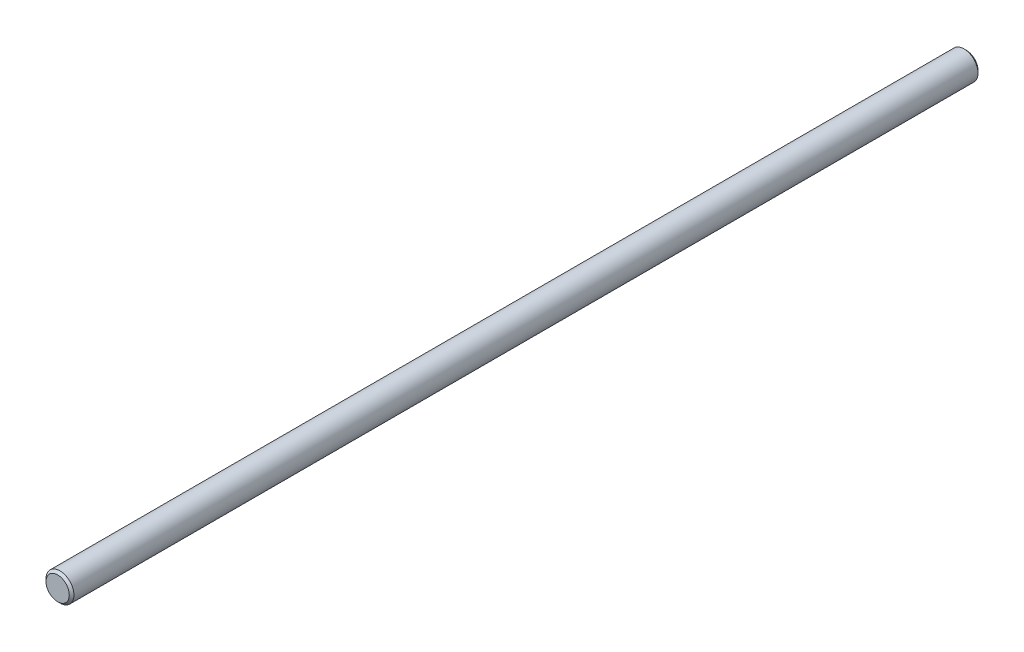
ISO-10303-21;
HEADER;
FILE_DESCRIPTION(('STEP AP214'),'2;1');
FILE_NAME('part.step','',(''),(''),'','','');
FILE_SCHEMA(('AUTOMOTIVE_DESIGN { 1 0 10303 214 1 1 1 1 }'));
ENDSEC;
DATA;
#1=APPLICATION_CONTEXT('core data for automotive mechanical design processes');
#2=APPLICATION_PROTOCOL_DEFINITION('international standard','automotive_design',2000,#1);
#3=PRODUCT_CONTEXT('',#1,'mechanical');
#4=PRODUCT('Part','Part','',(#3));
#5=PRODUCT_RELATED_PRODUCT_CATEGORY('part','',(#4));
#6=PRODUCT_DEFINITION_FORMATION('','',#4);
#7=PRODUCT_DEFINITION_CONTEXT('part definition',#1,'design');
#8=PRODUCT_DEFINITION('design','',#6,#7);
#9=PRODUCT_DEFINITION_SHAPE('','',#8);
#10=(LENGTH_UNIT() NAMED_UNIT(*) SI_UNIT(.MILLI.,.METRE.));
#11=(NAMED_UNIT(*) PLANE_ANGLE_UNIT() SI_UNIT($,.RADIAN.));
#12=(NAMED_UNIT(*) SI_UNIT($,.STERADIAN.) SOLID_ANGLE_UNIT());
#13=UNCERTAINTY_MEASURE_WITH_UNIT(LENGTH_MEASURE(1.E-05),#10,'distance_accuracy_value','');
#14=(GEOMETRIC_REPRESENTATION_CONTEXT(3) GLOBAL_UNCERTAINTY_ASSIGNED_CONTEXT((#13)) GLOBAL_UNIT_ASSIGNED_CONTEXT((#10,
#11,#12)) REPRESENTATION_CONTEXT('',''));
#15=CARTESIAN_POINT('',(0.,0.,0.));
#16=DIRECTION('',(0.,0.,1.));
#17=DIRECTION('',(1.,0.,0.));
#18=AXIS2_PLACEMENT_3D('',#15,#16,#17);
#19=CARTESIAN_POINT('',(0.,0.,390.));
#20=DIRECTION('',(0.,0.,-1.));
#21=DIRECTION('',(-1.,0.,0.));
#22=AXIS2_PLACEMENT_3D('',#19,#20,#21);
#23=CYLINDRICAL_SURFACE('',#22,6.);
#24=CARTESIAN_POINT('',(0.,0.,389.));
#25=DIRECTION('',(0.,0.,1.));
#26=DIRECTION('',(1.,0.,0.));
#27=AXIS2_PLACEMENT_3D('',#24,#25,#26);
#28=CIRCLE('',#27,6.);
#29=CARTESIAN_POINT('',(6.,0.,389.));
#30=VERTEX_POINT('',#29);
#31=EDGE_CURVE('E38',#30,#30,#28,.F.);
#32=ORIENTED_EDGE('',*,*,#31,.T.);
#33=EDGE_LOOP('',(#32));
#34=FACE_BOUND('',#33,.T.);
#35=CARTESIAN_POINT('',(0.,0.,0.999999999999945));
#36=DIRECTION('',(0.,0.,1.));
#37=DIRECTION('',(1.,0.,0.));
#38=AXIS2_PLACEMENT_3D('',#35,#36,#37);
#39=CIRCLE('',#38,6.);
#40=CARTESIAN_POINT('',(6.,0.,0.999999999999945));
#41=VERTEX_POINT('',#40);
#42=EDGE_CURVE('E42',#41,#41,#39,.T.);
#43=ORIENTED_EDGE('',*,*,#42,.T.);
#44=EDGE_LOOP('',(#43));
#45=FACE_BOUND('',#44,.T.);
#46=ADVANCED_FACE('F31',(#34,#45),#23,.T.);
#47=CARTESIAN_POINT('',(0.,0.,390.));
#48=DIRECTION('',(0.,0.,1.));
#49=DIRECTION('',(1.,0.,0.));
#50=AXIS2_PLACEMENT_3D('',#47,#48,#49);
#51=PLANE('',#50);
#52=CARTESIAN_POINT('',(0.,0.,390.));
#53=DIRECTION('',(0.,0.,1.));
#54=DIRECTION('',(1.,0.,0.));
#55=AXIS2_PLACEMENT_3D('',#52,#53,#54);
#56=CIRCLE('',#55,5.);
#57=CARTESIAN_POINT('',(5.,0.,390.));
#58=VERTEX_POINT('',#57);
#59=EDGE_CURVE('E46',#58,#58,#56,.T.);
#60=ORIENTED_EDGE('',*,*,#59,.T.);
#61=EDGE_LOOP('',(#60));
#62=FACE_BOUND('',#61,.T.);
#63=ADVANCED_FACE('F52',(#62),#51,.T.);
#64=CARTESIAN_POINT('',(0.,0.,0.));
#65=DIRECTION('',(0.,0.,1.));
#66=DIRECTION('',(1.,0.,0.));
#67=AXIS2_PLACEMENT_3D('',#64,#65,#66);
#68=PLANE('',#67);
#69=CARTESIAN_POINT('',(0.,0.,0.));
#70=DIRECTION('',(0.,0.,1.));
#71=DIRECTION('',(1.,0.,0.));
#72=AXIS2_PLACEMENT_3D('',#69,#70,#71);
#73=CIRCLE('',#72,5.00000000000006);
#74=CARTESIAN_POINT('',(5.00000000000006,0.,0.));
#75=VERTEX_POINT('',#74);
#76=EDGE_CURVE('E10',#75,#75,#73,.F.);
#77=ORIENTED_EDGE('',*,*,#76,.T.);
#78=EDGE_LOOP('',(#77));
#79=FACE_BOUND('',#78,.T.);
#80=ADVANCED_FACE('F56',(#79),#68,.F.);
#81=CARTESIAN_POINT('',(0.,0.,390.));
#82=DIRECTION('',(0.,0.,-1.));
#83=DIRECTION('',(-1.,0.,0.));
#84=AXIS2_PLACEMENT_3D('',#81,#82,#83);
#85=CONICAL_SURFACE('',#84,5.,0.785398163397446);
#86=ORIENTED_EDGE('',*,*,#31,.F.);
#87=EDGE_LOOP('',(#86));
#88=FACE_BOUND('',#87,.T.);
#89=ORIENTED_EDGE('',*,*,#59,.F.);
#90=EDGE_LOOP('',(#89));
#91=FACE_BOUND('',#90,.T.);
#92=ADVANCED_FACE('F54',(#88,#91),#85,.T.);
#93=CARTESIAN_POINT('',(0.,0.,0.999999999999945));
#94=DIRECTION('',(0.,0.,1.));
#95=DIRECTION('',(1.,0.,0.));
#96=AXIS2_PLACEMENT_3D('',#93,#94,#95);
#97=CONICAL_SURFACE('',#96,6.,0.785398163397446);
#98=ORIENTED_EDGE('',*,*,#76,.F.);
#99=EDGE_LOOP('',(#98));
#100=FACE_BOUND('',#99,.T.);
#101=ORIENTED_EDGE('',*,*,#42,.F.);
#102=EDGE_LOOP('',(#101));
#103=FACE_BOUND('',#102,.T.);
#104=ADVANCED_FACE('F33',(#100,#103),#97,.T.);
#105=CLOSED_SHELL('',(#46,#63,#80,#92,#104));
#106=MANIFOLD_SOLID_BREP('B2',#105);
#107=ADVANCED_BREP_SHAPE_REPRESENTATION('',(#18,#106),#14);
#108=SHAPE_DEFINITION_REPRESENTATION(#9,#107);
ENDSEC;
END-ISO-10303-21;
